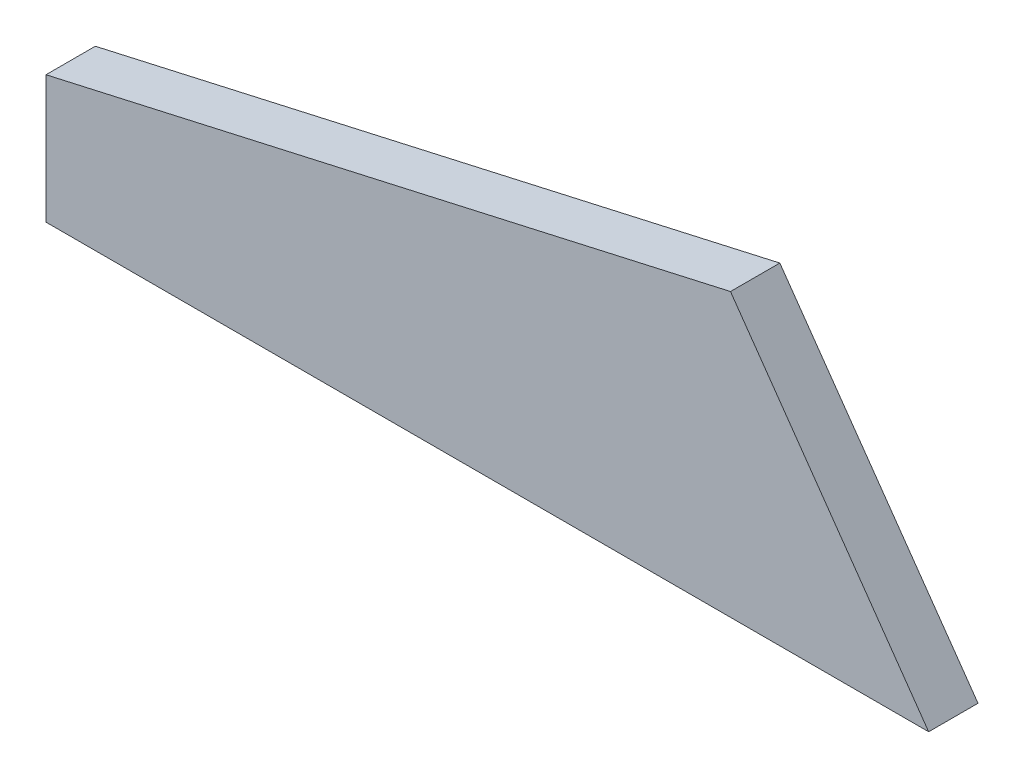
ISO-10303-21;
HEADER;
FILE_DESCRIPTION(('STEP AP214'),'2;1');
FILE_NAME('part.step','',(''),(''),'','','');
FILE_SCHEMA(('AUTOMOTIVE_DESIGN { 1 0 10303 214 1 1 1 1 }'));
ENDSEC;
DATA;
#1=APPLICATION_CONTEXT('core data for automotive mechanical design processes');
#2=APPLICATION_PROTOCOL_DEFINITION('international standard','automotive_design',2000,#1);
#3=PRODUCT_CONTEXT('',#1,'mechanical');
#4=PRODUCT('Part','Part','',(#3));
#5=PRODUCT_RELATED_PRODUCT_CATEGORY('part','',(#4));
#6=PRODUCT_DEFINITION_FORMATION('','',#4);
#7=PRODUCT_DEFINITION_CONTEXT('part definition',#1,'design');
#8=PRODUCT_DEFINITION('design','',#6,#7);
#9=PRODUCT_DEFINITION_SHAPE('','',#8);
#10=(LENGTH_UNIT() NAMED_UNIT(*) SI_UNIT(.MILLI.,.METRE.));
#11=(NAMED_UNIT(*) PLANE_ANGLE_UNIT() SI_UNIT($,.RADIAN.));
#12=(NAMED_UNIT(*) SI_UNIT($,.STERADIAN.) SOLID_ANGLE_UNIT());
#13=UNCERTAINTY_MEASURE_WITH_UNIT(LENGTH_MEASURE(1.E-05),#10,'distance_accuracy_value','');
#14=(GEOMETRIC_REPRESENTATION_CONTEXT(3) GLOBAL_UNCERTAINTY_ASSIGNED_CONTEXT((#13)) GLOBAL_UNIT_ASSIGNED_CONTEXT((#10,
#11,#12)) REPRESENTATION_CONTEXT('',''));
#15=CARTESIAN_POINT('',(0.,0.,0.));
#16=DIRECTION('',(0.,0.,1.));
#17=DIRECTION('',(1.,0.,0.));
#18=AXIS2_PLACEMENT_3D('',#15,#16,#17);
#19=CARTESIAN_POINT('',(37.0619892866787,81.0601739111511,8.5));
#20=DIRECTION('',(0.,1.,0.));
#21=DIRECTION('',(-1.,0.,0.));
#22=AXIS2_PLACEMENT_3D('',#19,#20,#21);
#23=PLANE('',#22);
#24=DIRECTION('',(1.,0.,0.));
#25=VECTOR('',#24,1.);
#26=CARTESIAN_POINT('',(37.0619892866787,81.0601739111511,0.));
#27=LINE('',#26,#25);
#28=CARTESIAN_POINT('',(-115.,81.0601739111511,0.));
#29=VERTEX_POINT('',#28);
#30=CARTESIAN_POINT('',(37.0619892866787,81.0601739111511,0.));
#31=VERTEX_POINT('',#30);
#32=EDGE_CURVE('E96',#29,#31,#27,.T.);
#33=ORIENTED_EDGE('',*,*,#32,.T.);
#34=DIRECTION('',(0.,0.,-1.));
#35=VECTOR('',#34,1.);
#36=CARTESIAN_POINT('',(37.0619892866787,81.0601739111511,8.5));
#37=LINE('',#36,#35);
#38=CARTESIAN_POINT('',(37.0619892866787,81.0601739111511,8.5));
#39=VERTEX_POINT('',#38);
#40=EDGE_CURVE('E11',#39,#31,#37,.T.);
#41=ORIENTED_EDGE('',*,*,#40,.F.);
#42=DIRECTION('',(1.,0.,0.));
#43=VECTOR('',#42,1.);
#44=CARTESIAN_POINT('',(37.0619892866787,81.0601739111511,8.5));
#45=LINE('',#44,#43);
#46=CARTESIAN_POINT('',(-115.,81.0601739111511,8.5));
#47=VERTEX_POINT('',#46);
#48=EDGE_CURVE('E84',#47,#39,#45,.T.);
#49=ORIENTED_EDGE('',*,*,#48,.F.);
#50=DIRECTION('',(0.,0.,-1.));
#51=VECTOR('',#50,1.);
#52=CARTESIAN_POINT('',(-115.,81.0601739111511,8.5));
#53=LINE('',#52,#51);
#54=EDGE_CURVE('E92',#47,#29,#53,.T.);
#55=ORIENTED_EDGE('',*,*,#54,.T.);
#56=EDGE_LOOP('',(#33,#41,#49,#55));
#57=FACE_BOUND('',#56,.T.);
#58=ADVANCED_FACE('F33',(#57),#23,.F.);
#59=CARTESIAN_POINT('',(2.92154551482114,129.674473857461,8.5));
#60=DIRECTION('',(-0.818357611223495,-0.574709335362299,0.));
#61=DIRECTION('',(0.574709335362299,-0.818357611223495,0.));
#62=AXIS2_PLACEMENT_3D('',#59,#60,#61);
#63=PLANE('',#62);
#64=DIRECTION('',(-0.574709335362299,0.818357611223495,0.));
#65=VECTOR('',#64,1.);
#66=CARTESIAN_POINT('',(2.92154551482114,129.674473857461,0.));
#67=LINE('',#66,#65);
#68=CARTESIAN_POINT('',(2.92154551482114,129.674473857461,0.));
#69=VERTEX_POINT('',#68);
#70=EDGE_CURVE('E88',#31,#69,#67,.T.);
#71=ORIENTED_EDGE('',*,*,#70,.T.);
#72=DIRECTION('',(0.,0.,-1.));
#73=VECTOR('',#72,1.);
#74=CARTESIAN_POINT('',(2.92154551482114,129.674473857461,8.5));
#75=LINE('',#74,#73);
#76=CARTESIAN_POINT('',(2.92154551482114,129.674473857461,8.5));
#77=VERTEX_POINT('',#76);
#78=EDGE_CURVE('E41',#77,#69,#75,.T.);
#79=ORIENTED_EDGE('',*,*,#78,.F.);
#80=DIRECTION('',(-0.574709335362299,0.818357611223495,0.));
#81=VECTOR('',#80,1.);
#82=CARTESIAN_POINT('',(2.92154551482114,129.674473857461,8.5));
#83=LINE('',#82,#81);
#84=EDGE_CURVE('E79',#39,#77,#83,.T.);
#85=ORIENTED_EDGE('',*,*,#84,.F.);
#86=ORIENTED_EDGE('',*,*,#40,.T.);
#87=EDGE_LOOP('',(#71,#79,#85,#86));
#88=FACE_BOUND('',#87,.T.);
#89=ADVANCED_FACE('F87',(#88),#63,.F.);
#90=CARTESIAN_POINT('',(-115.,103.060173911151,8.5));
#91=DIRECTION('',(0.220157401784986,-0.975464360414713,0.));
#92=DIRECTION('',(0.975464360414713,0.220157401784986,0.));
#93=AXIS2_PLACEMENT_3D('',#90,#91,#92);
#94=PLANE('',#93);
#95=DIRECTION('',(-0.975464360414713,-0.220157401784985,0.));
#96=VECTOR('',#95,1.);
#97=CARTESIAN_POINT('',(-115.,103.060173911151,0.));
#98=LINE('',#97,#96);
#99=CARTESIAN_POINT('',(-115.,103.060173911151,0.));
#100=VERTEX_POINT('',#99);
#101=EDGE_CURVE('E66',#69,#100,#98,.T.);
#102=ORIENTED_EDGE('',*,*,#101,.T.);
#103=DIRECTION('',(0.,0.,-1.));
#104=VECTOR('',#103,1.);
#105=CARTESIAN_POINT('',(-115.,103.060173911151,8.5));
#106=LINE('',#105,#104);
#107=CARTESIAN_POINT('',(-115.,103.060173911151,8.5));
#108=VERTEX_POINT('',#107);
#109=EDGE_CURVE('E89',#108,#100,#106,.T.);
#110=ORIENTED_EDGE('',*,*,#109,.F.);
#111=DIRECTION('',(-0.975464360414713,-0.220157401784985,0.));
#112=VECTOR('',#111,1.);
#113=CARTESIAN_POINT('',(-115.,103.060173911151,8.5));
#114=LINE('',#113,#112);
#115=EDGE_CURVE('E82',#77,#108,#114,.T.);
#116=ORIENTED_EDGE('',*,*,#115,.F.);
#117=ORIENTED_EDGE('',*,*,#78,.T.);
#118=EDGE_LOOP('',(#102,#110,#116,#117));
#119=FACE_BOUND('',#118,.T.);
#120=ADVANCED_FACE('F90',(#119),#94,.F.);
#121=CARTESIAN_POINT('',(-115.,81.0601739111511,8.5));
#122=DIRECTION('',(1.,0.,0.));
#123=DIRECTION('',(0.,1.,0.));
#124=AXIS2_PLACEMENT_3D('',#121,#122,#123);
#125=PLANE('',#124);
#126=DIRECTION('',(0.,-1.,0.));
#127=VECTOR('',#126,1.);
#128=CARTESIAN_POINT('',(-115.,81.0601739111511,0.));
#129=LINE('',#128,#127);
#130=EDGE_CURVE('E72',#100,#29,#129,.T.);
#131=ORIENTED_EDGE('',*,*,#130,.T.);
#132=ORIENTED_EDGE('',*,*,#54,.F.);
#133=DIRECTION('',(0.,-1.,0.));
#134=VECTOR('',#133,1.);
#135=CARTESIAN_POINT('',(-115.,81.0601739111511,8.5));
#136=LINE('',#135,#134);
#137=EDGE_CURVE('E49',#108,#47,#136,.T.);
#138=ORIENTED_EDGE('',*,*,#137,.F.);
#139=ORIENTED_EDGE('',*,*,#109,.T.);
#140=EDGE_LOOP('',(#131,#132,#138,#139));
#141=FACE_BOUND('',#140,.T.);
#142=ADVANCED_FACE('F103',(#141),#125,.F.);
#143=CARTESIAN_POINT('',(0.,0.,8.5));
#144=DIRECTION('',(0.,0.,-1.));
#145=DIRECTION('',(-1.,0.,0.));
#146=AXIS2_PLACEMENT_3D('',#143,#144,#145);
#147=PLANE('',#146);
#148=ORIENTED_EDGE('',*,*,#48,.T.);
#149=ORIENTED_EDGE('',*,*,#84,.T.);
#150=ORIENTED_EDGE('',*,*,#115,.T.);
#151=ORIENTED_EDGE('',*,*,#137,.T.);
#152=EDGE_LOOP('',(#148,#149,#150,#151));
#153=FACE_BOUND('',#152,.T.);
#154=ADVANCED_FACE('F80',(#153),#147,.F.);
#155=CARTESIAN_POINT('',(0.,0.,0.));
#156=DIRECTION('',(0.,0.,-1.));
#157=DIRECTION('',(-1.,0.,0.));
#158=AXIS2_PLACEMENT_3D('',#155,#156,#157);
#159=PLANE('',#158);
#160=ORIENTED_EDGE('',*,*,#32,.F.);
#161=ORIENTED_EDGE('',*,*,#130,.F.);
#162=ORIENTED_EDGE('',*,*,#101,.F.);
#163=ORIENTED_EDGE('',*,*,#70,.F.);
#164=EDGE_LOOP('',(#160,#161,#162,#163));
#165=FACE_BOUND('',#164,.T.);
#166=ADVANCED_FACE('F106',(#165),#159,.T.);
#167=CLOSED_SHELL('',(#58,#89,#120,#142,#154,#166));
#168=MANIFOLD_SOLID_BREP('B2',#167);
#169=ADVANCED_BREP_SHAPE_REPRESENTATION('',(#18,#168),#14);
#170=SHAPE_DEFINITION_REPRESENTATION(#9,#169);
ENDSEC;
END-ISO-10303-21;
